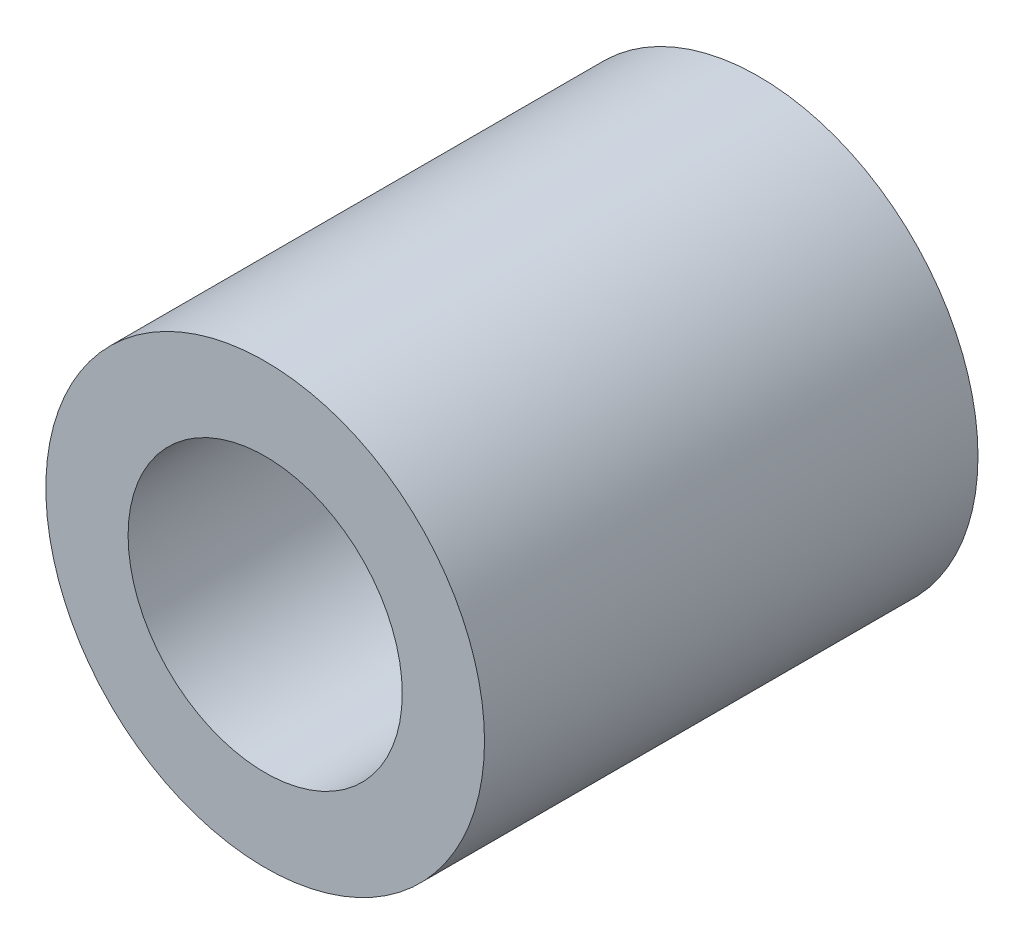
ISO-10303-21;
HEADER;
FILE_DESCRIPTION(('STEP AP214'),'2;1');
FILE_NAME('part.step','',(''),(''),'','','');
FILE_SCHEMA(('AUTOMOTIVE_DESIGN { 1 0 10303 214 1 1 1 1 }'));
ENDSEC;
DATA;
#1=APPLICATION_CONTEXT('core data for automotive mechanical design processes');
#2=APPLICATION_PROTOCOL_DEFINITION('international standard','automotive_design',2000,#1);
#3=PRODUCT_CONTEXT('',#1,'mechanical');
#4=PRODUCT('Part','Part','',(#3));
#5=PRODUCT_RELATED_PRODUCT_CATEGORY('part','',(#4));
#6=PRODUCT_DEFINITION_FORMATION('','',#4);
#7=PRODUCT_DEFINITION_CONTEXT('part definition',#1,'design');
#8=PRODUCT_DEFINITION('design','',#6,#7);
#9=PRODUCT_DEFINITION_SHAPE('','',#8);
#10=(LENGTH_UNIT() NAMED_UNIT(*) SI_UNIT(.MILLI.,.METRE.));
#11=(NAMED_UNIT(*) PLANE_ANGLE_UNIT() SI_UNIT($,.RADIAN.));
#12=(NAMED_UNIT(*) SI_UNIT($,.STERADIAN.) SOLID_ANGLE_UNIT());
#13=UNCERTAINTY_MEASURE_WITH_UNIT(LENGTH_MEASURE(1.E-05),#10,'distance_accuracy_value','');
#14=(GEOMETRIC_REPRESENTATION_CONTEXT(3) GLOBAL_UNCERTAINTY_ASSIGNED_CONTEXT((#13)) GLOBAL_UNIT_ASSIGNED_CONTEXT((#10,
#11,#12)) REPRESENTATION_CONTEXT('',''));
#15=CARTESIAN_POINT('',(0.,0.,0.));
#16=DIRECTION('',(0.,0.,1.));
#17=DIRECTION('',(1.,0.,0.));
#18=AXIS2_PLACEMENT_3D('',#15,#16,#17);
#19=CARTESIAN_POINT('',(0.,0.,18.));
#20=DIRECTION('',(0.,0.,1.));
#21=DIRECTION('',(1.,0.,0.));
#22=AXIS2_PLACEMENT_3D('',#19,#20,#21);
#23=PLANE('',#22);
#24=CARTESIAN_POINT('',(0.,0.,18.));
#25=DIRECTION('',(0.,0.,1.));
#26=DIRECTION('',(1.,0.,0.));
#27=AXIS2_PLACEMENT_3D('',#24,#25,#26);
#28=CIRCLE('',#27,8.);
#29=CARTESIAN_POINT('',(8.,0.,18.));
#30=VERTEX_POINT('',#29);
#31=EDGE_CURVE('E10',#30,#30,#28,.T.);
#32=ORIENTED_EDGE('',*,*,#31,.T.);
#33=EDGE_LOOP('',(#32));
#34=FACE_BOUND('',#33,.T.);
#35=CARTESIAN_POINT('',(0.,0.,18.));
#36=DIRECTION('',(0.,0.,1.));
#37=DIRECTION('',(1.,0.,0.));
#38=AXIS2_PLACEMENT_3D('',#35,#36,#37);
#39=CIRCLE('',#38,5.);
#40=CARTESIAN_POINT('',(5.,0.,18.));
#41=VERTEX_POINT('',#40);
#42=EDGE_CURVE('E50',#41,#41,#39,.T.);
#43=ORIENTED_EDGE('',*,*,#42,.F.);
#44=EDGE_LOOP('',(#43));
#45=FACE_BOUND('',#44,.T.);
#46=ADVANCED_FACE('F37',(#34,#45),#23,.T.);
#47=CARTESIAN_POINT('',(0.,0.,0.));
#48=DIRECTION('',(0.,0.,1.));
#49=DIRECTION('',(1.,0.,0.));
#50=AXIS2_PLACEMENT_3D('',#47,#48,#49);
#51=PLANE('',#50);
#52=CARTESIAN_POINT('',(0.,0.,0.));
#53=DIRECTION('',(0.,0.,1.));
#54=DIRECTION('',(1.,0.,0.));
#55=AXIS2_PLACEMENT_3D('',#52,#53,#54);
#56=CIRCLE('',#55,8.);
#57=CARTESIAN_POINT('',(8.,0.,0.));
#58=VERTEX_POINT('',#57);
#59=EDGE_CURVE('E41',#58,#58,#56,.T.);
#60=ORIENTED_EDGE('',*,*,#59,.F.);
#61=EDGE_LOOP('',(#60));
#62=FACE_BOUND('',#61,.T.);
#63=CARTESIAN_POINT('',(0.,0.,0.));
#64=DIRECTION('',(0.,0.,1.));
#65=DIRECTION('',(1.,0.,0.));
#66=AXIS2_PLACEMENT_3D('',#63,#64,#65);
#67=CIRCLE('',#66,5.);
#68=CARTESIAN_POINT('',(5.,0.,0.));
#69=VERTEX_POINT('',#68);
#70=EDGE_CURVE('E52',#69,#69,#67,.T.);
#71=ORIENTED_EDGE('',*,*,#70,.T.);
#72=EDGE_LOOP('',(#71));
#73=FACE_BOUND('',#72,.T.);
#74=ADVANCED_FACE('F64',(#62,#73),#51,.F.);
#75=CARTESIAN_POINT('',(0.,0.,18.));
#76=DIRECTION('',(0.,0.,-1.));
#77=DIRECTION('',(-1.,0.,0.));
#78=AXIS2_PLACEMENT_3D('',#75,#76,#77);
#79=CYLINDRICAL_SURFACE('',#78,8.);
#80=ORIENTED_EDGE('',*,*,#31,.F.);
#81=EDGE_LOOP('',(#80));
#82=FACE_BOUND('',#81,.T.);
#83=ORIENTED_EDGE('',*,*,#59,.T.);
#84=EDGE_LOOP('',(#83));
#85=FACE_BOUND('',#84,.T.);
#86=ADVANCED_FACE('F39',(#82,#85),#79,.T.);
#87=CARTESIAN_POINT('',(0.,0.,18.));
#88=DIRECTION('',(0.,0.,-1.));
#89=DIRECTION('',(-1.,0.,0.));
#90=AXIS2_PLACEMENT_3D('',#87,#88,#89);
#91=CYLINDRICAL_SURFACE('',#90,5.);
#92=ORIENTED_EDGE('',*,*,#42,.T.);
#93=EDGE_LOOP('',(#92));
#94=FACE_BOUND('',#93,.T.);
#95=ORIENTED_EDGE('',*,*,#70,.F.);
#96=EDGE_LOOP('',(#95));
#97=FACE_BOUND('',#96,.T.);
#98=ADVANCED_FACE('F60',(#94,#97),#91,.F.);
#99=CLOSED_SHELL('',(#46,#74,#86,#98));
#100=MANIFOLD_SOLID_BREP('B2',#99);
#101=ADVANCED_BREP_SHAPE_REPRESENTATION('',(#18,#100),#14);
#102=SHAPE_DEFINITION_REPRESENTATION(#9,#101);
ENDSEC;
END-ISO-10303-21;
